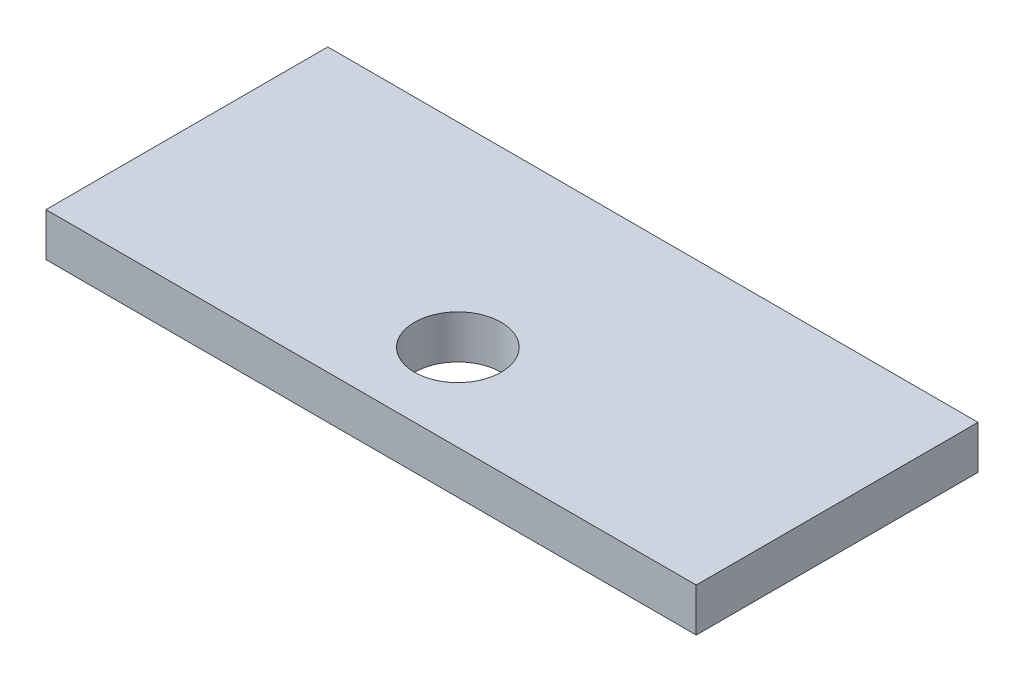
ISO-10303-21;
HEADER;
FILE_DESCRIPTION(('STEP AP214'),'2;1');
FILE_NAME('part.step','',(''),(''),'','','');
FILE_SCHEMA(('AUTOMOTIVE_DESIGN { 1 0 10303 214 1 1 1 1 }'));
ENDSEC;
DATA;
#1=APPLICATION_CONTEXT('core data for automotive mechanical design processes');
#2=APPLICATION_PROTOCOL_DEFINITION('international standard','automotive_design',2000,#1);
#3=PRODUCT_CONTEXT('',#1,'mechanical');
#4=PRODUCT('Part','Part','',(#3));
#5=PRODUCT_RELATED_PRODUCT_CATEGORY('part','',(#4));
#6=PRODUCT_DEFINITION_FORMATION('','',#4);
#7=PRODUCT_DEFINITION_CONTEXT('part definition',#1,'design');
#8=PRODUCT_DEFINITION('design','',#6,#7);
#9=PRODUCT_DEFINITION_SHAPE('','',#8);
#10=(LENGTH_UNIT() NAMED_UNIT(*) SI_UNIT(.MILLI.,.METRE.));
#11=(NAMED_UNIT(*) PLANE_ANGLE_UNIT() SI_UNIT($,.RADIAN.));
#12=(NAMED_UNIT(*) SI_UNIT($,.STERADIAN.) SOLID_ANGLE_UNIT());
#13=UNCERTAINTY_MEASURE_WITH_UNIT(LENGTH_MEASURE(1.E-05),#10,'distance_accuracy_value','');
#14=(GEOMETRIC_REPRESENTATION_CONTEXT(3) GLOBAL_UNCERTAINTY_ASSIGNED_CONTEXT((#13)) GLOBAL_UNIT_ASSIGNED_CONTEXT((#10,
#11,#12)) REPRESENTATION_CONTEXT('',''));
#15=CARTESIAN_POINT('',(0.,0.,0.));
#16=DIRECTION('',(0.,0.,1.));
#17=DIRECTION('',(1.,0.,0.));
#18=AXIS2_PLACEMENT_3D('',#15,#16,#17);
#19=CARTESIAN_POINT('',(75.,10.,32.5));
#20=DIRECTION('',(-1.,0.,0.));
#21=DIRECTION('',(0.,0.,1.));
#22=AXIS2_PLACEMENT_3D('',#19,#20,#21);
#23=PLANE('',#22);
#24=DIRECTION('',(0.,0.,-1.));
#25=VECTOR('',#24,1.);
#26=CARTESIAN_POINT('',(75.,0.,32.5));
#27=LINE('',#26,#25);
#28=CARTESIAN_POINT('',(75.,0.,32.5));
#29=VERTEX_POINT('',#28);
#30=CARTESIAN_POINT('',(75.,0.,-32.5));
#31=VERTEX_POINT('',#30);
#32=EDGE_CURVE('E111',#29,#31,#27,.T.);
#33=ORIENTED_EDGE('',*,*,#32,.T.);
#34=DIRECTION('',(0.,-1.,0.));
#35=VECTOR('',#34,1.);
#36=CARTESIAN_POINT('',(75.,10.,-32.5));
#37=LINE('',#36,#35);
#38=CARTESIAN_POINT('',(75.,10.,-32.5));
#39=VERTEX_POINT('',#38);
#40=EDGE_CURVE('E11',#39,#31,#37,.T.);
#41=ORIENTED_EDGE('',*,*,#40,.F.);
#42=DIRECTION('',(0.,0.,-1.));
#43=VECTOR('',#42,1.);
#44=CARTESIAN_POINT('',(75.,10.,32.5));
#45=LINE('',#44,#43);
#46=CARTESIAN_POINT('',(75.,10.,32.5));
#47=VERTEX_POINT('',#46);
#48=EDGE_CURVE('E94',#47,#39,#45,.T.);
#49=ORIENTED_EDGE('',*,*,#48,.F.);
#50=DIRECTION('',(0.,-1.,0.));
#51=VECTOR('',#50,1.);
#52=CARTESIAN_POINT('',(75.,10.,32.5));
#53=LINE('',#52,#51);
#54=EDGE_CURVE('E107',#47,#29,#53,.T.);
#55=ORIENTED_EDGE('',*,*,#54,.T.);
#56=EDGE_LOOP('',(#33,#41,#49,#55));
#57=FACE_BOUND('',#56,.T.);
#58=ADVANCED_FACE('F41',(#57),#23,.F.);
#59=CARTESIAN_POINT('',(-75.,10.,-32.5));
#60=DIRECTION('',(0.,0.,1.));
#61=DIRECTION('',(1.,0.,0.));
#62=AXIS2_PLACEMENT_3D('',#59,#60,#61);
#63=PLANE('',#62);
#64=DIRECTION('',(-1.,0.,0.));
#65=VECTOR('',#64,1.);
#66=CARTESIAN_POINT('',(-75.,0.,-32.5));
#67=LINE('',#66,#65);
#68=CARTESIAN_POINT('',(-75.,0.,-32.5));
#69=VERTEX_POINT('',#68);
#70=EDGE_CURVE('E99',#31,#69,#67,.T.);
#71=ORIENTED_EDGE('',*,*,#70,.T.);
#72=DIRECTION('',(0.,-1.,0.));
#73=VECTOR('',#72,1.);
#74=CARTESIAN_POINT('',(-75.,10.,-32.5));
#75=LINE('',#74,#73);
#76=CARTESIAN_POINT('',(-75.,10.,-32.5));
#77=VERTEX_POINT('',#76);
#78=EDGE_CURVE('E51',#77,#69,#75,.T.);
#79=ORIENTED_EDGE('',*,*,#78,.F.);
#80=DIRECTION('',(-1.,0.,0.));
#81=VECTOR('',#80,1.);
#82=CARTESIAN_POINT('',(-75.,10.,-32.5));
#83=LINE('',#82,#81);
#84=EDGE_CURVE('E89',#39,#77,#83,.T.);
#85=ORIENTED_EDGE('',*,*,#84,.F.);
#86=ORIENTED_EDGE('',*,*,#40,.T.);
#87=EDGE_LOOP('',(#71,#79,#85,#86));
#88=FACE_BOUND('',#87,.T.);
#89=ADVANCED_FACE('F98',(#88),#63,.F.);
#90=CARTESIAN_POINT('',(-75.,10.,32.5));
#91=DIRECTION('',(1.,0.,0.));
#92=DIRECTION('',(0.,0.,-1.));
#93=AXIS2_PLACEMENT_3D('',#90,#91,#92);
#94=PLANE('',#93);
#95=DIRECTION('',(0.,0.,1.));
#96=VECTOR('',#95,1.);
#97=CARTESIAN_POINT('',(-75.,0.,32.5));
#98=LINE('',#97,#96);
#99=CARTESIAN_POINT('',(-75.,0.,32.5));
#100=VERTEX_POINT('',#99);
#101=EDGE_CURVE('E76',#69,#100,#98,.T.);
#102=ORIENTED_EDGE('',*,*,#101,.T.);
#103=DIRECTION('',(0.,-1.,0.));
#104=VECTOR('',#103,1.);
#105=CARTESIAN_POINT('',(-75.,10.,32.5));
#106=LINE('',#105,#104);
#107=CARTESIAN_POINT('',(-75.,10.,32.5));
#108=VERTEX_POINT('',#107);
#109=EDGE_CURVE('E101',#108,#100,#106,.T.);
#110=ORIENTED_EDGE('',*,*,#109,.F.);
#111=DIRECTION('',(0.,0.,1.));
#112=VECTOR('',#111,1.);
#113=CARTESIAN_POINT('',(-75.,10.,32.5));
#114=LINE('',#113,#112);
#115=EDGE_CURVE('E92',#77,#108,#114,.T.);
#116=ORIENTED_EDGE('',*,*,#115,.F.);
#117=ORIENTED_EDGE('',*,*,#78,.T.);
#118=EDGE_LOOP('',(#102,#110,#116,#117));
#119=FACE_BOUND('',#118,.T.);
#120=ADVANCED_FACE('F103',(#119),#94,.F.);
#121=CARTESIAN_POINT('',(-75.,10.,32.5));
#122=DIRECTION('',(0.,0.,-1.));
#123=DIRECTION('',(-1.,0.,0.));
#124=AXIS2_PLACEMENT_3D('',#121,#122,#123);
#125=PLANE('',#124);
#126=DIRECTION('',(1.,0.,0.));
#127=VECTOR('',#126,1.);
#128=CARTESIAN_POINT('',(-75.,0.,32.5));
#129=LINE('',#128,#127);
#130=EDGE_CURVE('E82',#100,#29,#129,.T.);
#131=ORIENTED_EDGE('',*,*,#130,.T.);
#132=ORIENTED_EDGE('',*,*,#54,.F.);
#133=DIRECTION('',(1.,0.,0.));
#134=VECTOR('',#133,1.);
#135=CARTESIAN_POINT('',(-75.,10.,32.5));
#136=LINE('',#135,#134);
#137=EDGE_CURVE('E59',#108,#47,#136,.T.);
#138=ORIENTED_EDGE('',*,*,#137,.F.);
#139=ORIENTED_EDGE('',*,*,#109,.T.);
#140=EDGE_LOOP('',(#131,#132,#138,#139));
#141=FACE_BOUND('',#140,.T.);
#142=ADVANCED_FACE('F124',(#141),#125,.F.);
#143=CARTESIAN_POINT('',(0.,10.,0.));
#144=DIRECTION('',(0.,-1.,0.));
#145=DIRECTION('',(0.,0.,-1.));
#146=AXIS2_PLACEMENT_3D('',#143,#144,#145);
#147=PLANE('',#146);
#148=CARTESIAN_POINT('',(0.,10.,12.5));
#149=DIRECTION('',(0.,1.,0.));
#150=DIRECTION('',(0.,0.,1.));
#151=AXIS2_PLACEMENT_3D('',#148,#149,#150);
#152=CIRCLE('',#151,10.);
#153=CARTESIAN_POINT('',(0.,10.,22.5));
#154=VERTEX_POINT('',#153);
#155=EDGE_CURVE('E131',#154,#154,#152,.T.);
#156=ORIENTED_EDGE('',*,*,#155,.F.);
#157=EDGE_LOOP('',(#156));
#158=FACE_BOUND('',#157,.T.);
#159=ORIENTED_EDGE('',*,*,#48,.T.);
#160=ORIENTED_EDGE('',*,*,#84,.T.);
#161=ORIENTED_EDGE('',*,*,#115,.T.);
#162=ORIENTED_EDGE('',*,*,#137,.T.);
#163=EDGE_LOOP('',(#159,#160,#161,#162));
#164=FACE_BOUND('',#163,.T.);
#165=ADVANCED_FACE('F90',(#158,#164),#147,.F.);
#166=CARTESIAN_POINT('',(0.,0.,0.));
#167=DIRECTION('',(0.,-1.,0.));
#168=DIRECTION('',(0.,0.,-1.));
#169=AXIS2_PLACEMENT_3D('',#166,#167,#168);
#170=PLANE('',#169);
#171=CARTESIAN_POINT('',(0.,0.,12.5));
#172=DIRECTION('',(0.,-1.,0.));
#173=DIRECTION('',(0.,0.,-1.));
#174=AXIS2_PLACEMENT_3D('',#171,#172,#173);
#175=CIRCLE('',#174,10.);
#176=CARTESIAN_POINT('',(0.,0.,2.5));
#177=VERTEX_POINT('',#176);
#178=EDGE_CURVE('E44',#177,#177,#175,.T.);
#179=ORIENTED_EDGE('',*,*,#178,.F.);
#180=EDGE_LOOP('',(#179));
#181=FACE_BOUND('',#180,.T.);
#182=ORIENTED_EDGE('',*,*,#32,.F.);
#183=ORIENTED_EDGE('',*,*,#130,.F.);
#184=ORIENTED_EDGE('',*,*,#101,.F.);
#185=ORIENTED_EDGE('',*,*,#70,.F.);
#186=EDGE_LOOP('',(#182,#183,#184,#185));
#187=FACE_BOUND('',#186,.T.);
#188=ADVANCED_FACE('F127',(#181,#187),#170,.T.);
#189=CARTESIAN_POINT('',(0.,-1.2E-05,12.5));
#190=DIRECTION('',(0.,1.,0.));
#191=DIRECTION('',(0.,0.,1.));
#192=AXIS2_PLACEMENT_3D('',#189,#190,#191);
#193=CYLINDRICAL_SURFACE('',#192,10.);
#194=ORIENTED_EDGE('',*,*,#178,.T.);
#195=EDGE_LOOP('',(#194));
#196=FACE_BOUND('',#195,.T.);
#197=ORIENTED_EDGE('',*,*,#155,.T.);
#198=EDGE_LOOP('',(#197));
#199=FACE_BOUND('',#198,.T.);
#200=ADVANCED_FACE('F140',(#196,#199),#193,.F.);
#201=CLOSED_SHELL('',(#58,#89,#120,#142,#165,#188,#200));
#202=MANIFOLD_SOLID_BREP('B2',#201);
#203=ADVANCED_BREP_SHAPE_REPRESENTATION('',(#18,#202),#14);
#204=SHAPE_DEFINITION_REPRESENTATION(#9,#203);
ENDSEC;
END-ISO-10303-21;
